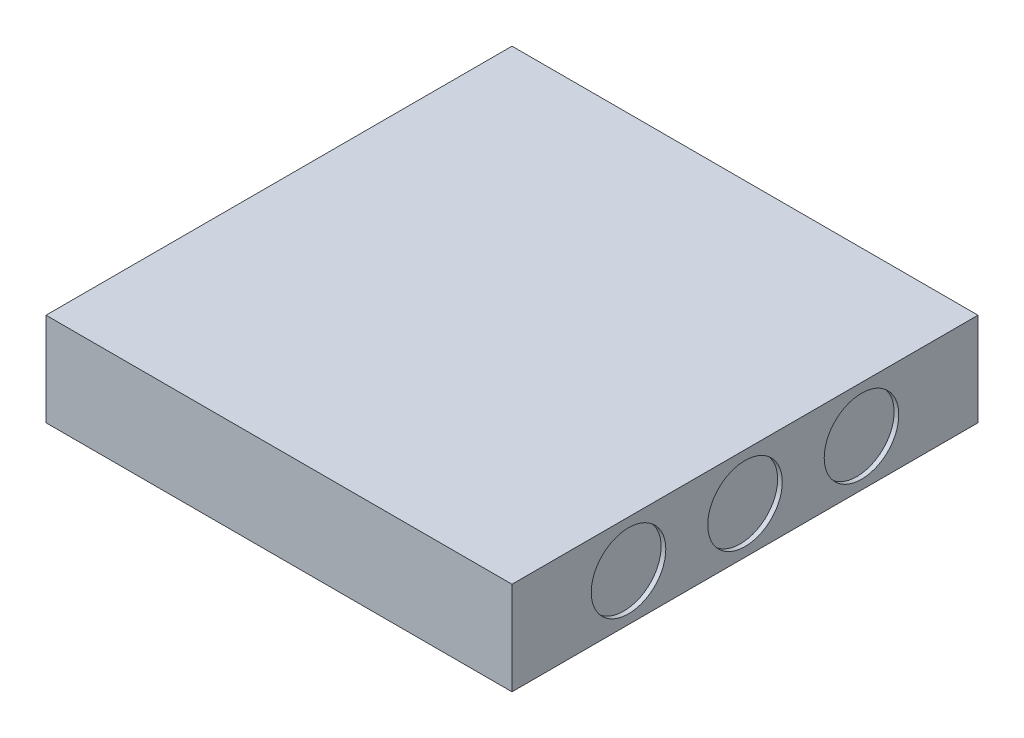
ISO-10303-21;
HEADER;
FILE_DESCRIPTION(('STEP AP214'),'2;1');
FILE_NAME('part.step','',(''),(''),'','','');
FILE_SCHEMA(('AUTOMOTIVE_DESIGN { 1 0 10303 214 1 1 1 1 }'));
ENDSEC;
DATA;
#1=APPLICATION_CONTEXT('core data for automotive mechanical design processes');
#2=APPLICATION_PROTOCOL_DEFINITION('international standard','automotive_design',2000,#1);
#3=PRODUCT_CONTEXT('',#1,'mechanical');
#4=PRODUCT('Part','Part','',(#3));
#5=PRODUCT_RELATED_PRODUCT_CATEGORY('part','',(#4));
#6=PRODUCT_DEFINITION_FORMATION('','',#4);
#7=PRODUCT_DEFINITION_CONTEXT('part definition',#1,'design');
#8=PRODUCT_DEFINITION('design','',#6,#7);
#9=PRODUCT_DEFINITION_SHAPE('','',#8);
#10=(LENGTH_UNIT() NAMED_UNIT(*) SI_UNIT(.MILLI.,.METRE.));
#11=(NAMED_UNIT(*) PLANE_ANGLE_UNIT() SI_UNIT($,.RADIAN.));
#12=(NAMED_UNIT(*) SI_UNIT($,.STERADIAN.) SOLID_ANGLE_UNIT());
#13=UNCERTAINTY_MEASURE_WITH_UNIT(LENGTH_MEASURE(1.E-05),#10,'distance_accuracy_value','');
#14=(GEOMETRIC_REPRESENTATION_CONTEXT(3) GLOBAL_UNCERTAINTY_ASSIGNED_CONTEXT((#13)) GLOBAL_UNIT_ASSIGNED_CONTEXT((#10,
#11,#12)) REPRESENTATION_CONTEXT('',''));
#15=CARTESIAN_POINT('',(0.,0.,0.));
#16=DIRECTION('',(0.,0.,1.));
#17=DIRECTION('',(1.,0.,0.));
#18=AXIS2_PLACEMENT_3D('',#15,#16,#17);
#19=CARTESIAN_POINT('',(25.,10.,25.));
#20=DIRECTION('',(-1.,0.,0.));
#21=DIRECTION('',(0.,0.,1.));
#22=AXIS2_PLACEMENT_3D('',#19,#20,#21);
#23=PLANE('',#22);
#24=CARTESIAN_POINT('',(25.,5.,0.));
#25=DIRECTION('',(1.,0.,0.));
#26=DIRECTION('',(0.,0.,-1.));
#27=AXIS2_PLACEMENT_3D('',#24,#25,#26);
#28=CIRCLE('',#27,4.);
#29=CARTESIAN_POINT('',(25.,5.,-4.));
#30=VERTEX_POINT('',#29);
#31=EDGE_CURVE('E200',#30,#30,#28,.T.);
#32=ORIENTED_EDGE('',*,*,#31,.F.);
#33=EDGE_LOOP('',(#32));
#34=FACE_BOUND('',#33,.T.);
#35=CARTESIAN_POINT('',(25.,5.,-12.5));
#36=DIRECTION('',(1.,0.,0.));
#37=DIRECTION('',(0.,0.,1.));
#38=AXIS2_PLACEMENT_3D('',#35,#36,#37);
#39=CIRCLE('',#38,4.);
#40=CARTESIAN_POINT('',(25.,5.,-8.5));
#41=VERTEX_POINT('',#40);
#42=EDGE_CURVE('E204',#41,#41,#39,.T.);
#43=ORIENTED_EDGE('',*,*,#42,.F.);
#44=EDGE_LOOP('',(#43));
#45=FACE_BOUND('',#44,.T.);
#46=CARTESIAN_POINT('',(25.,5.,12.5));
#47=DIRECTION('',(1.,0.,0.));
#48=DIRECTION('',(0.,0.,-1.));
#49=AXIS2_PLACEMENT_3D('',#46,#47,#48);
#50=CIRCLE('',#49,4.);
#51=CARTESIAN_POINT('',(25.,5.,8.5));
#52=VERTEX_POINT('',#51);
#53=EDGE_CURVE('E131',#52,#52,#50,.T.);
#54=ORIENTED_EDGE('',*,*,#53,.F.);
#55=EDGE_LOOP('',(#54));
#56=FACE_BOUND('',#55,.T.);
#57=DIRECTION('',(0.,0.,-1.));
#58=VECTOR('',#57,1.);
#59=CARTESIAN_POINT('',(25.,0.,25.));
#60=LINE('',#59,#58);
#61=CARTESIAN_POINT('',(25.,0.,25.));
#62=VERTEX_POINT('',#61);
#63=CARTESIAN_POINT('',(25.,0.,-25.));
#64=VERTEX_POINT('',#63);
#65=EDGE_CURVE('E144',#62,#64,#60,.T.);
#66=ORIENTED_EDGE('',*,*,#65,.T.);
#67=DIRECTION('',(0.,-1.,0.));
#68=VECTOR('',#67,1.);
#69=CARTESIAN_POINT('',(25.,10.,-25.));
#70=LINE('',#69,#68);
#71=CARTESIAN_POINT('',(25.,10.,-25.));
#72=VERTEX_POINT('',#71);
#73=EDGE_CURVE('E11',#72,#64,#70,.T.);
#74=ORIENTED_EDGE('',*,*,#73,.F.);
#75=DIRECTION('',(0.,0.,-1.));
#76=VECTOR('',#75,1.);
#77=CARTESIAN_POINT('',(25.,10.,25.));
#78=LINE('',#77,#76);
#79=CARTESIAN_POINT('',(25.,10.,25.));
#80=VERTEX_POINT('',#79);
#81=EDGE_CURVE('E148',#80,#72,#78,.T.);
#82=ORIENTED_EDGE('',*,*,#81,.F.);
#83=DIRECTION('',(0.,-1.,0.));
#84=VECTOR('',#83,1.);
#85=CARTESIAN_POINT('',(25.,10.,25.));
#86=LINE('',#85,#84);
#87=EDGE_CURVE('E154',#80,#62,#86,.T.);
#88=ORIENTED_EDGE('',*,*,#87,.T.);
#89=EDGE_LOOP('',(#66,#74,#82,#88));
#90=FACE_BOUND('',#89,.T.);
#91=ADVANCED_FACE('F32',(#34,#45,#56,#90),#23,.F.);
#92=CARTESIAN_POINT('',(-25.,10.,-25.));
#93=DIRECTION('',(0.,0.,1.));
#94=DIRECTION('',(1.,0.,0.));
#95=AXIS2_PLACEMENT_3D('',#92,#93,#94);
#96=PLANE('',#95);
#97=DIRECTION('',(-1.,0.,0.));
#98=VECTOR('',#97,1.);
#99=CARTESIAN_POINT('',(-25.,0.,-25.));
#100=LINE('',#99,#98);
#101=CARTESIAN_POINT('',(-25.,0.,-25.));
#102=VERTEX_POINT('',#101);
#103=EDGE_CURVE('E157',#64,#102,#100,.T.);
#104=ORIENTED_EDGE('',*,*,#103,.T.);
#105=DIRECTION('',(0.,-1.,0.));
#106=VECTOR('',#105,1.);
#107=CARTESIAN_POINT('',(-25.,10.,-25.));
#108=LINE('',#107,#106);
#109=CARTESIAN_POINT('',(-25.,10.,-25.));
#110=VERTEX_POINT('',#109);
#111=EDGE_CURVE('E39',#110,#102,#108,.T.);
#112=ORIENTED_EDGE('',*,*,#111,.F.);
#113=DIRECTION('',(-1.,0.,0.));
#114=VECTOR('',#113,1.);
#115=CARTESIAN_POINT('',(-25.,10.,-25.));
#116=LINE('',#115,#114);
#117=EDGE_CURVE('E83',#72,#110,#116,.T.);
#118=ORIENTED_EDGE('',*,*,#117,.F.);
#119=ORIENTED_EDGE('',*,*,#73,.T.);
#120=EDGE_LOOP('',(#104,#112,#118,#119));
#121=FACE_BOUND('',#120,.T.);
#122=ADVANCED_FACE('F186',(#121),#96,.F.);
#123=CARTESIAN_POINT('',(-25.,10.,25.));
#124=DIRECTION('',(1.,0.,0.));
#125=DIRECTION('',(0.,0.,-1.));
#126=AXIS2_PLACEMENT_3D('',#123,#124,#125);
#127=PLANE('',#126);
#128=DIRECTION('',(0.,0.,-1.));
#129=VECTOR('',#128,1.);
#130=CARTESIAN_POINT('',(-25.,7.5,-2.5));
#131=LINE('',#130,#129);
#132=CARTESIAN_POINT('',(-25.,7.5,2.5));
#133=VERTEX_POINT('',#132);
#134=CARTESIAN_POINT('',(-25.,7.5,-2.5));
#135=VERTEX_POINT('',#134);
#136=EDGE_CURVE('E137',#133,#135,#131,.T.);
#137=ORIENTED_EDGE('',*,*,#136,.F.);
#138=DIRECTION('',(0.,1.,0.));
#139=VECTOR('',#138,1.);
#140=CARTESIAN_POINT('',(-25.,7.5,2.5));
#141=LINE('',#140,#139);
#142=CARTESIAN_POINT('',(-25.,2.5,2.5));
#143=VERTEX_POINT('',#142);
#144=EDGE_CURVE('E46',#143,#133,#141,.T.);
#145=ORIENTED_EDGE('',*,*,#144,.F.);
#146=DIRECTION('',(0.,0.,1.));
#147=VECTOR('',#146,1.);
#148=CARTESIAN_POINT('',(-25.,2.5,-2.5));
#149=LINE('',#148,#147);
#150=CARTESIAN_POINT('',(-25.,2.5,-2.5));
#151=VERTEX_POINT('',#150);
#152=EDGE_CURVE('E125',#151,#143,#149,.T.);
#153=ORIENTED_EDGE('',*,*,#152,.F.);
#154=DIRECTION('',(0.,-1.,0.));
#155=VECTOR('',#154,1.);
#156=CARTESIAN_POINT('',(-25.,7.5,-2.5));
#157=LINE('',#156,#155);
#158=EDGE_CURVE('E128',#135,#151,#157,.T.);
#159=ORIENTED_EDGE('',*,*,#158,.F.);
#160=EDGE_LOOP('',(#137,#145,#153,#159));
#161=FACE_BOUND('',#160,.T.);
#162=DIRECTION('',(0.,0.,1.));
#163=VECTOR('',#162,1.);
#164=CARTESIAN_POINT('',(-25.,0.,25.));
#165=LINE('',#164,#163);
#166=CARTESIAN_POINT('',(-25.,0.,25.));
#167=VERTEX_POINT('',#166);
#168=EDGE_CURVE('E159',#102,#167,#165,.T.);
#169=ORIENTED_EDGE('',*,*,#168,.T.);
#170=DIRECTION('',(0.,-1.,0.));
#171=VECTOR('',#170,1.);
#172=CARTESIAN_POINT('',(-25.,10.,25.));
#173=LINE('',#172,#171);
#174=CARTESIAN_POINT('',(-25.,10.,25.));
#175=VERTEX_POINT('',#174);
#176=EDGE_CURVE('E163',#175,#167,#173,.T.);
#177=ORIENTED_EDGE('',*,*,#176,.F.);
#178=DIRECTION('',(0.,0.,1.));
#179=VECTOR('',#178,1.);
#180=CARTESIAN_POINT('',(-25.,10.,25.));
#181=LINE('',#180,#179);
#182=EDGE_CURVE('E151',#110,#175,#181,.T.);
#183=ORIENTED_EDGE('',*,*,#182,.F.);
#184=ORIENTED_EDGE('',*,*,#111,.T.);
#185=EDGE_LOOP('',(#169,#177,#183,#184));
#186=FACE_BOUND('',#185,.T.);
#187=ADVANCED_FACE('F168',(#161,#186),#127,.F.);
#188=CARTESIAN_POINT('',(-25.,10.,25.));
#189=DIRECTION('',(0.,0.,-1.));
#190=DIRECTION('',(-1.,0.,0.));
#191=AXIS2_PLACEMENT_3D('',#188,#189,#190);
#192=PLANE('',#191);
#193=DIRECTION('',(1.,0.,0.));
#194=VECTOR('',#193,1.);
#195=CARTESIAN_POINT('',(-25.,0.,25.));
#196=LINE('',#195,#194);
#197=EDGE_CURVE('E76',#167,#62,#196,.T.);
#198=ORIENTED_EDGE('',*,*,#197,.T.);
#199=ORIENTED_EDGE('',*,*,#87,.F.);
#200=DIRECTION('',(1.,0.,0.));
#201=VECTOR('',#200,1.);
#202=CARTESIAN_POINT('',(-25.,10.,25.));
#203=LINE('',#202,#201);
#204=EDGE_CURVE('E55',#175,#80,#203,.T.);
#205=ORIENTED_EDGE('',*,*,#204,.F.);
#206=ORIENTED_EDGE('',*,*,#176,.T.);
#207=EDGE_LOOP('',(#198,#199,#205,#206));
#208=FACE_BOUND('',#207,.T.);
#209=ADVANCED_FACE('F176',(#208),#192,.F.);
#210=CARTESIAN_POINT('',(0.,10.,0.));
#211=DIRECTION('',(0.,-1.,0.));
#212=DIRECTION('',(0.,0.,-1.));
#213=AXIS2_PLACEMENT_3D('',#210,#211,#212);
#214=PLANE('',#213);
#215=ORIENTED_EDGE('',*,*,#81,.T.);
#216=ORIENTED_EDGE('',*,*,#117,.T.);
#217=ORIENTED_EDGE('',*,*,#182,.T.);
#218=ORIENTED_EDGE('',*,*,#204,.T.);
#219=EDGE_LOOP('',(#215,#216,#217,#218));
#220=FACE_BOUND('',#219,.T.);
#221=ADVANCED_FACE('F178',(#220),#214,.F.);
#222=CARTESIAN_POINT('',(0.,0.,0.));
#223=DIRECTION('',(0.,-1.,0.));
#224=DIRECTION('',(0.,0.,-1.));
#225=AXIS2_PLACEMENT_3D('',#222,#223,#224);
#226=PLANE('',#225);
#227=ORIENTED_EDGE('',*,*,#65,.F.);
#228=ORIENTED_EDGE('',*,*,#197,.F.);
#229=ORIENTED_EDGE('',*,*,#168,.F.);
#230=ORIENTED_EDGE('',*,*,#103,.F.);
#231=EDGE_LOOP('',(#227,#228,#229,#230));
#232=FACE_BOUND('',#231,.T.);
#233=ADVANCED_FACE('F172',(#232),#226,.T.);
#234=CARTESIAN_POINT('',(-19.,7.5,2.5));
#235=DIRECTION('',(0.,0.,1.));
#236=DIRECTION('',(1.,0.,0.));
#237=AXIS2_PLACEMENT_3D('',#234,#235,#236);
#238=PLANE('',#237);
#239=ORIENTED_EDGE('',*,*,#144,.T.);
#240=DIRECTION('',(-1.,0.,0.));
#241=VECTOR('',#240,1.);
#242=CARTESIAN_POINT('',(-19.,7.5,2.5));
#243=LINE('',#242,#241);
#244=CARTESIAN_POINT('',(-19.,7.5,2.5));
#245=VERTEX_POINT('',#244);
#246=EDGE_CURVE('E103',#245,#133,#243,.T.);
#247=ORIENTED_EDGE('',*,*,#246,.F.);
#248=DIRECTION('',(0.,1.,0.));
#249=VECTOR('',#248,1.);
#250=CARTESIAN_POINT('',(-19.,7.5,2.5));
#251=LINE('',#250,#249);
#252=CARTESIAN_POINT('',(-19.,2.5,2.5));
#253=VERTEX_POINT('',#252);
#254=EDGE_CURVE('E107',#253,#245,#251,.T.);
#255=ORIENTED_EDGE('',*,*,#254,.F.);
#256=DIRECTION('',(-1.,0.,0.));
#257=VECTOR('',#256,1.);
#258=CARTESIAN_POINT('',(-19.,2.5,2.5));
#259=LINE('',#258,#257);
#260=EDGE_CURVE('E142',#253,#143,#259,.T.);
#261=ORIENTED_EDGE('',*,*,#260,.T.);
#262=EDGE_LOOP('',(#239,#247,#255,#261));
#263=FACE_BOUND('',#262,.T.);
#264=ADVANCED_FACE('F105',(#263),#238,.F.);
#265=CARTESIAN_POINT('',(-19.,2.5,-2.5));
#266=DIRECTION('',(0.,-1.,0.));
#267=DIRECTION('',(0.,0.,-1.));
#268=AXIS2_PLACEMENT_3D('',#265,#266,#267);
#269=PLANE('',#268);
#270=ORIENTED_EDGE('',*,*,#152,.T.);
#271=ORIENTED_EDGE('',*,*,#260,.F.);
#272=DIRECTION('',(0.,0.,1.));
#273=VECTOR('',#272,1.);
#274=CARTESIAN_POINT('',(-19.,2.5,-2.5));
#275=LINE('',#274,#273);
#276=CARTESIAN_POINT('',(-19.,2.5,-2.5));
#277=VERTEX_POINT('',#276);
#278=EDGE_CURVE('E113',#277,#253,#275,.T.);
#279=ORIENTED_EDGE('',*,*,#278,.F.);
#280=DIRECTION('',(-1.,0.,0.));
#281=VECTOR('',#280,1.);
#282=CARTESIAN_POINT('',(-19.,2.5,-2.5));
#283=LINE('',#282,#281);
#284=EDGE_CURVE('E145',#277,#151,#283,.T.);
#285=ORIENTED_EDGE('',*,*,#284,.T.);
#286=EDGE_LOOP('',(#270,#271,#279,#285));
#287=FACE_BOUND('',#286,.T.);
#288=ADVANCED_FACE('F249',(#287),#269,.F.);
#289=CARTESIAN_POINT('',(-19.,7.5,-2.5));
#290=DIRECTION('',(0.,0.,-1.));
#291=DIRECTION('',(0.,1.,0.));
#292=AXIS2_PLACEMENT_3D('',#289,#290,#291);
#293=PLANE('',#292);
#294=ORIENTED_EDGE('',*,*,#158,.T.);
#295=ORIENTED_EDGE('',*,*,#284,.F.);
#296=DIRECTION('',(0.,-1.,0.));
#297=VECTOR('',#296,1.);
#298=CARTESIAN_POINT('',(-19.,7.5,-2.5));
#299=LINE('',#298,#297);
#300=CARTESIAN_POINT('',(-19.,7.5,-2.5));
#301=VERTEX_POINT('',#300);
#302=EDGE_CURVE('E121',#301,#277,#299,.T.);
#303=ORIENTED_EDGE('',*,*,#302,.F.);
#304=DIRECTION('',(-1.,0.,0.));
#305=VECTOR('',#304,1.);
#306=CARTESIAN_POINT('',(-19.,7.5,-2.5));
#307=LINE('',#306,#305);
#308=EDGE_CURVE('E112',#301,#135,#307,.T.);
#309=ORIENTED_EDGE('',*,*,#308,.T.);
#310=EDGE_LOOP('',(#294,#295,#303,#309));
#311=FACE_BOUND('',#310,.T.);
#312=ADVANCED_FACE('F252',(#311),#293,.F.);
#313=CARTESIAN_POINT('',(-19.,7.5,-2.5));
#314=DIRECTION('',(0.,1.,0.));
#315=DIRECTION('',(0.,0.,1.));
#316=AXIS2_PLACEMENT_3D('',#313,#314,#315);
#317=PLANE('',#316);
#318=ORIENTED_EDGE('',*,*,#136,.T.);
#319=ORIENTED_EDGE('',*,*,#308,.F.);
#320=DIRECTION('',(0.,0.,-1.));
#321=VECTOR('',#320,1.);
#322=CARTESIAN_POINT('',(-19.,7.5,-2.5));
#323=LINE('',#322,#321);
#324=EDGE_CURVE('E116',#245,#301,#323,.T.);
#325=ORIENTED_EDGE('',*,*,#324,.F.);
#326=ORIENTED_EDGE('',*,*,#246,.T.);
#327=EDGE_LOOP('',(#318,#319,#325,#326));
#328=FACE_BOUND('',#327,.T.);
#329=ADVANCED_FACE('F117',(#328),#317,.F.);
#330=CARTESIAN_POINT('',(-19.,0.,0.));
#331=DIRECTION('',(-1.,0.,0.));
#332=DIRECTION('',(0.,0.,1.));
#333=AXIS2_PLACEMENT_3D('',#330,#331,#332);
#334=PLANE('',#333);
#335=ORIENTED_EDGE('',*,*,#254,.T.);
#336=ORIENTED_EDGE('',*,*,#324,.T.);
#337=ORIENTED_EDGE('',*,*,#302,.T.);
#338=ORIENTED_EDGE('',*,*,#278,.T.);
#339=EDGE_LOOP('',(#335,#336,#337,#338));
#340=FACE_BOUND('',#339,.T.);
#341=ADVANCED_FACE('F123',(#340),#334,.T.);
#342=CARTESIAN_POINT('',(24.5,5.,12.5));
#343=DIRECTION('',(1.,0.,0.));
#344=DIRECTION('',(0.,0.,-1.));
#345=AXIS2_PLACEMENT_3D('',#342,#343,#344);
#346=CYLINDRICAL_SURFACE('',#345,4.);
#347=CARTESIAN_POINT('',(24.5,5.,12.5));
#348=DIRECTION('',(1.,0.,0.));
#349=DIRECTION('',(0.,0.,-1.));
#350=AXIS2_PLACEMENT_3D('',#347,#348,#349);
#351=CIRCLE('',#350,4.);
#352=CARTESIAN_POINT('',(24.5,5.,8.5));
#353=VERTEX_POINT('',#352);
#354=EDGE_CURVE('E138',#353,#353,#351,.T.);
#355=ORIENTED_EDGE('',*,*,#354,.F.);
#356=EDGE_LOOP('',(#355));
#357=FACE_BOUND('',#356,.T.);
#358=ORIENTED_EDGE('',*,*,#53,.T.);
#359=EDGE_LOOP('',(#358));
#360=FACE_BOUND('',#359,.T.);
#361=ADVANCED_FACE('F242',(#357,#360),#346,.F.);
#362=CARTESIAN_POINT('',(24.5,5.,12.5));
#363=DIRECTION('',(1.,0.,0.));
#364=DIRECTION('',(0.,0.,-1.));
#365=AXIS2_PLACEMENT_3D('',#362,#363,#364);
#366=PLANE('',#365);
#367=ORIENTED_EDGE('',*,*,#354,.T.);
#368=EDGE_LOOP('',(#367));
#369=FACE_BOUND('',#368,.T.);
#370=ADVANCED_FACE('F238',(#369),#366,.T.);
#371=CARTESIAN_POINT('',(24.5,5.,-12.5));
#372=DIRECTION('',(1.,0.,0.));
#373=DIRECTION('',(0.,0.,-1.));
#374=AXIS2_PLACEMENT_3D('',#371,#372,#373);
#375=CYLINDRICAL_SURFACE('',#374,4.);
#376=CARTESIAN_POINT('',(24.5,5.,-12.5));
#377=DIRECTION('',(1.,0.,0.));
#378=DIRECTION('',(0.,0.,1.));
#379=AXIS2_PLACEMENT_3D('',#376,#377,#378);
#380=CIRCLE('',#379,4.);
#381=CARTESIAN_POINT('',(24.5,5.,-8.5));
#382=VERTEX_POINT('',#381);
#383=EDGE_CURVE('E208',#382,#382,#380,.T.);
#384=ORIENTED_EDGE('',*,*,#383,.F.);
#385=EDGE_LOOP('',(#384));
#386=FACE_BOUND('',#385,.T.);
#387=ORIENTED_EDGE('',*,*,#42,.T.);
#388=EDGE_LOOP('',(#387));
#389=FACE_BOUND('',#388,.T.);
#390=ADVANCED_FACE('F233',(#386,#389),#375,.F.);
#391=CARTESIAN_POINT('',(24.5,5.,-12.5));
#392=DIRECTION('',(-1.,0.,0.));
#393=DIRECTION('',(0.,0.,1.));
#394=AXIS2_PLACEMENT_3D('',#391,#392,#393);
#395=PLANE('',#394);
#396=ORIENTED_EDGE('',*,*,#383,.T.);
#397=EDGE_LOOP('',(#396));
#398=FACE_BOUND('',#397,.T.);
#399=ADVANCED_FACE('F226',(#398),#395,.F.);
#400=CARTESIAN_POINT('',(24.5,5.,0.));
#401=DIRECTION('',(1.,0.,0.));
#402=DIRECTION('',(0.,0.,-1.));
#403=AXIS2_PLACEMENT_3D('',#400,#401,#402);
#404=CYLINDRICAL_SURFACE('',#403,4.);
#405=CARTESIAN_POINT('',(24.5,5.,0.));
#406=DIRECTION('',(1.,0.,0.));
#407=DIRECTION('',(0.,0.,-1.));
#408=AXIS2_PLACEMENT_3D('',#405,#406,#407);
#409=CIRCLE('',#408,4.);
#410=CARTESIAN_POINT('',(24.5,5.,-4.));
#411=VERTEX_POINT('',#410);
#412=EDGE_CURVE('E214',#411,#411,#409,.T.);
#413=ORIENTED_EDGE('',*,*,#412,.F.);
#414=EDGE_LOOP('',(#413));
#415=FACE_BOUND('',#414,.T.);
#416=ORIENTED_EDGE('',*,*,#31,.T.);
#417=EDGE_LOOP('',(#416));
#418=FACE_BOUND('',#417,.T.);
#419=ADVANCED_FACE('F223',(#415,#418),#404,.F.);
#420=CARTESIAN_POINT('',(24.5,5.,0.));
#421=DIRECTION('',(1.,0.,0.));
#422=DIRECTION('',(0.,0.,-1.));
#423=AXIS2_PLACEMENT_3D('',#420,#421,#422);
#424=PLANE('',#423);
#425=ORIENTED_EDGE('',*,*,#412,.T.);
#426=EDGE_LOOP('',(#425));
#427=FACE_BOUND('',#426,.T.);
#428=ADVANCED_FACE('F221',(#427),#424,.T.);
#429=CLOSED_SHELL('',(#91,#122,#187,#209,#221,#233,#264,#288,#312,#329,#341,#361,#370,#390,#399,
#419,#428));
#430=MANIFOLD_SOLID_BREP('B2',#429);
#431=ADVANCED_BREP_SHAPE_REPRESENTATION('',(#18,#430),#14);
#432=SHAPE_DEFINITION_REPRESENTATION(#9,#431);
ENDSEC;
END-ISO-10303-21;
